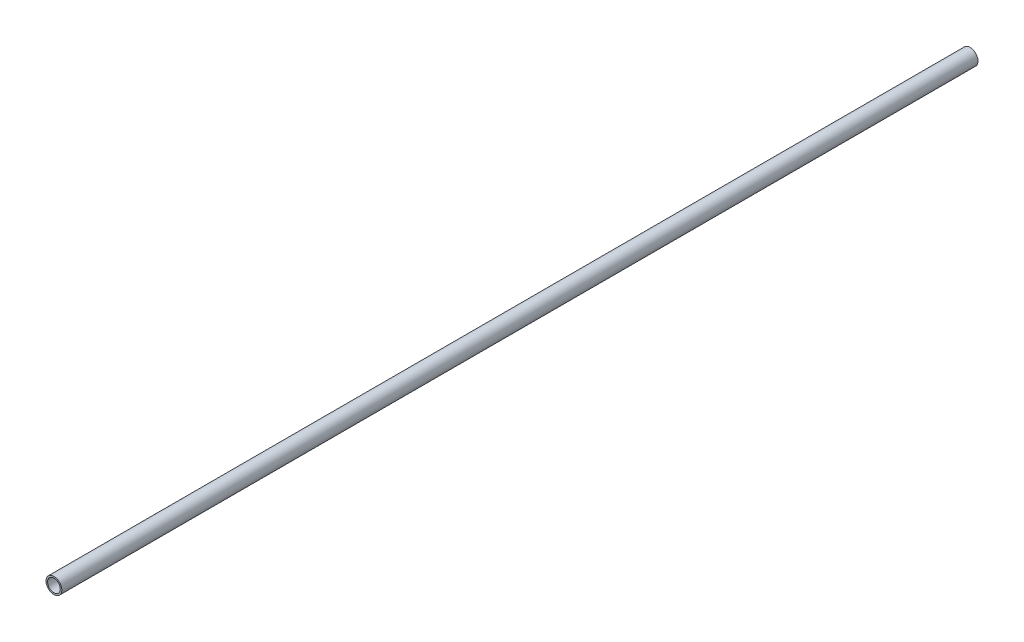
ISO-10303-21;
HEADER;
FILE_DESCRIPTION(('STEP AP214'),'2;1');
FILE_NAME('part.step','',(''),(''),'','','');
FILE_SCHEMA(('AUTOMOTIVE_DESIGN { 1 0 10303 214 1 1 1 1 }'));
ENDSEC;
DATA;
#1=APPLICATION_CONTEXT('core data for automotive mechanical design processes');
#2=APPLICATION_PROTOCOL_DEFINITION('international standard','automotive_design',2000,#1);
#3=PRODUCT_CONTEXT('',#1,'mechanical');
#4=PRODUCT('Part','Part','',(#3));
#5=PRODUCT_RELATED_PRODUCT_CATEGORY('part','',(#4));
#6=PRODUCT_DEFINITION_FORMATION('','',#4);
#7=PRODUCT_DEFINITION_CONTEXT('part definition',#1,'design');
#8=PRODUCT_DEFINITION('design','',#6,#7);
#9=PRODUCT_DEFINITION_SHAPE('','',#8);
#10=(LENGTH_UNIT() NAMED_UNIT(*) SI_UNIT(.MILLI.,.METRE.));
#11=(NAMED_UNIT(*) PLANE_ANGLE_UNIT() SI_UNIT($,.RADIAN.));
#12=(NAMED_UNIT(*) SI_UNIT($,.STERADIAN.) SOLID_ANGLE_UNIT());
#13=UNCERTAINTY_MEASURE_WITH_UNIT(LENGTH_MEASURE(1.E-05),#10,'distance_accuracy_value','');
#14=(GEOMETRIC_REPRESENTATION_CONTEXT(3) GLOBAL_UNCERTAINTY_ASSIGNED_CONTEXT((#13)) GLOBAL_UNIT_ASSIGNED_CONTEXT((#10,
#11,#12)) REPRESENTATION_CONTEXT('',''));
#15=CARTESIAN_POINT('',(0.,0.,0.));
#16=DIRECTION('',(0.,0.,1.));
#17=DIRECTION('',(1.,0.,0.));
#18=AXIS2_PLACEMENT_3D('',#15,#16,#17);
#19=CARTESIAN_POINT('',(0.,0.,914.4));
#20=DIRECTION('',(0.,0.,1.));
#21=DIRECTION('',(1.,0.,0.));
#22=AXIS2_PLACEMENT_3D('',#19,#20,#21);
#23=PLANE('',#22);
#24=CARTESIAN_POINT('',(0.,0.,914.4));
#25=DIRECTION('',(0.,0.,1.));
#26=DIRECTION('',(1.,0.,0.));
#27=AXIS2_PLACEMENT_3D('',#24,#25,#26);
#28=CIRCLE('',#27,15.7988);
#29=CARTESIAN_POINT('',(15.7988,0.,914.4));
#30=VERTEX_POINT('',#29);
#31=EDGE_CURVE('E10',#30,#30,#28,.T.);
#32=ORIENTED_EDGE('',*,*,#31,.T.);
#33=EDGE_LOOP('',(#32));
#34=FACE_BOUND('',#33,.T.);
#35=CARTESIAN_POINT('',(0.,0.,914.4));
#36=DIRECTION('',(0.,0.,1.));
#37=DIRECTION('',(1.,0.,0.));
#38=AXIS2_PLACEMENT_3D('',#35,#36,#37);
#39=CIRCLE('',#38,12.7);
#40=CARTESIAN_POINT('',(12.7,0.,914.4));
#41=VERTEX_POINT('',#40);
#42=EDGE_CURVE('E49',#41,#41,#39,.T.);
#43=ORIENTED_EDGE('',*,*,#42,.F.);
#44=EDGE_LOOP('',(#43));
#45=FACE_BOUND('',#44,.T.);
#46=ADVANCED_FACE('F41',(#34,#45),#23,.T.);
#47=CARTESIAN_POINT('',(0.,0.,914.4));
#48=DIRECTION('',(0.,0.,-1.));
#49=DIRECTION('',(-1.,0.,0.));
#50=AXIS2_PLACEMENT_3D('',#47,#48,#49);
#51=CYLINDRICAL_SURFACE('',#50,15.7988);
#52=ORIENTED_EDGE('',*,*,#31,.F.);
#53=EDGE_LOOP('',(#52));
#54=FACE_BOUND('',#53,.T.);
#55=CARTESIAN_POINT('',(0.,0.,-914.4));
#56=DIRECTION('',(0.,0.,1.));
#57=DIRECTION('',(1.,0.,0.));
#58=AXIS2_PLACEMENT_3D('',#55,#56,#57);
#59=CIRCLE('',#58,15.7988);
#60=CARTESIAN_POINT('',(15.7988,0.,-914.4));
#61=VERTEX_POINT('',#60);
#62=EDGE_CURVE('E54',#61,#61,#59,.T.);
#63=ORIENTED_EDGE('',*,*,#62,.T.);
#64=EDGE_LOOP('',(#63));
#65=FACE_BOUND('',#64,.T.);
#66=ADVANCED_FACE('F43',(#54,#65),#51,.T.);
#67=CARTESIAN_POINT('',(0.,0.,914.4));
#68=DIRECTION('',(0.,0.,-1.));
#69=DIRECTION('',(-1.,0.,0.));
#70=AXIS2_PLACEMENT_3D('',#67,#68,#69);
#71=CYLINDRICAL_SURFACE('',#70,12.7);
#72=ORIENTED_EDGE('',*,*,#42,.T.);
#73=EDGE_LOOP('',(#72));
#74=FACE_BOUND('',#73,.T.);
#75=CARTESIAN_POINT('',(0.,0.,-914.4));
#76=DIRECTION('',(0.,0.,1.));
#77=DIRECTION('',(1.,0.,0.));
#78=AXIS2_PLACEMENT_3D('',#75,#76,#77);
#79=CIRCLE('',#78,12.7);
#80=CARTESIAN_POINT('',(12.7,0.,-914.4));
#81=VERTEX_POINT('',#80);
#82=EDGE_CURVE('E59',#81,#81,#79,.T.);
#83=ORIENTED_EDGE('',*,*,#82,.F.);
#84=EDGE_LOOP('',(#83));
#85=FACE_BOUND('',#84,.T.);
#86=ADVANCED_FACE('F69',(#74,#85),#71,.F.);
#87=CARTESIAN_POINT('',(0.,0.,-914.4));
#88=DIRECTION('',(0.,0.,1.));
#89=DIRECTION('',(1.,0.,0.));
#90=AXIS2_PLACEMENT_3D('',#87,#88,#89);
#91=PLANE('',#90);
#92=ORIENTED_EDGE('',*,*,#82,.T.);
#93=EDGE_LOOP('',(#92));
#94=FACE_BOUND('',#93,.T.);
#95=ORIENTED_EDGE('',*,*,#62,.F.);
#96=EDGE_LOOP('',(#95));
#97=FACE_BOUND('',#96,.T.);
#98=ADVANCED_FACE('F66',(#94,#97),#91,.F.);
#99=CLOSED_SHELL('',(#46,#66,#86,#98));
#100=MANIFOLD_SOLID_BREP('B2',#99);
#101=ADVANCED_BREP_SHAPE_REPRESENTATION('',(#18,#100),#14);
#102=SHAPE_DEFINITION_REPRESENTATION(#9,#101);
ENDSEC;
END-ISO-10303-21;
